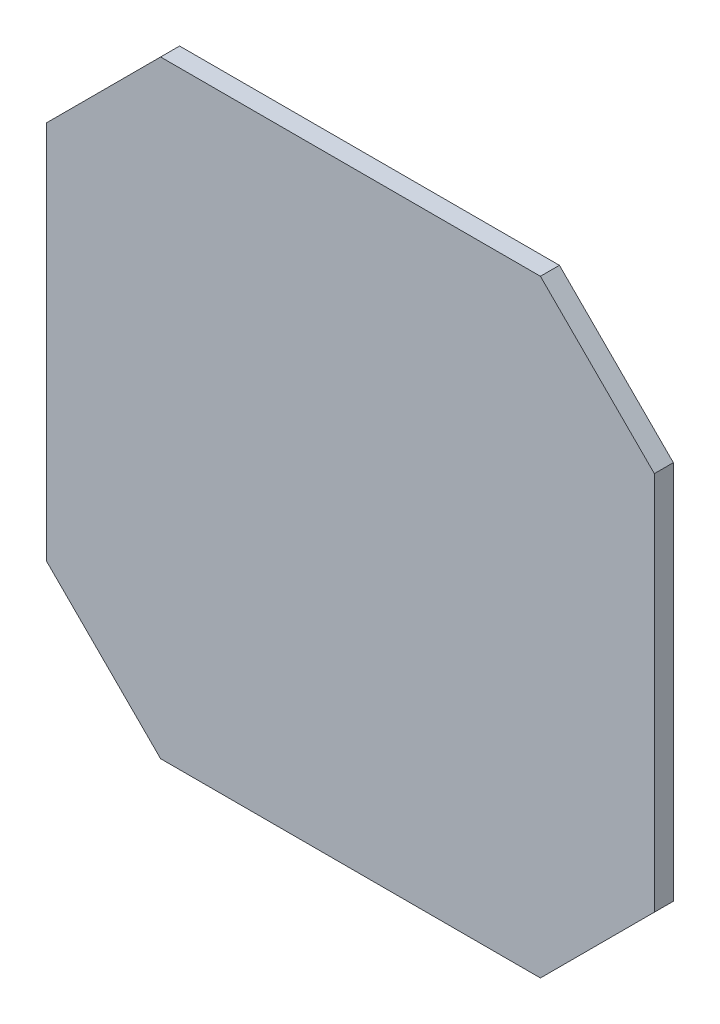
ISO-10303-21;
HEADER;
FILE_DESCRIPTION(('STEP AP214'),'2;1');
FILE_NAME('part.step','',(''),(''),'','','');
FILE_SCHEMA(('AUTOMOTIVE_DESIGN { 1 0 10303 214 1 1 1 1 }'));
ENDSEC;
DATA;
#1=APPLICATION_CONTEXT('core data for automotive mechanical design processes');
#2=APPLICATION_PROTOCOL_DEFINITION('international standard','automotive_design',2000,#1);
#3=PRODUCT_CONTEXT('',#1,'mechanical');
#4=PRODUCT('Part','Part','',(#3));
#5=PRODUCT_RELATED_PRODUCT_CATEGORY('part','',(#4));
#6=PRODUCT_DEFINITION_FORMATION('','',#4);
#7=PRODUCT_DEFINITION_CONTEXT('part definition',#1,'design');
#8=PRODUCT_DEFINITION('design','',#6,#7);
#9=PRODUCT_DEFINITION_SHAPE('','',#8);
#10=(LENGTH_UNIT() NAMED_UNIT(*) SI_UNIT(.MILLI.,.METRE.));
#11=(NAMED_UNIT(*) PLANE_ANGLE_UNIT() SI_UNIT($,.RADIAN.));
#12=(NAMED_UNIT(*) SI_UNIT($,.STERADIAN.) SOLID_ANGLE_UNIT());
#13=UNCERTAINTY_MEASURE_WITH_UNIT(LENGTH_MEASURE(1.E-05),#10,'distance_accuracy_value','');
#14=(GEOMETRIC_REPRESENTATION_CONTEXT(3) GLOBAL_UNCERTAINTY_ASSIGNED_CONTEXT((#13)) GLOBAL_UNIT_ASSIGNED_CONTEXT((#10,
#11,#12)) REPRESENTATION_CONTEXT('',''));
#15=CARTESIAN_POINT('',(0.,0.,0.));
#16=DIRECTION('',(0.,0.,1.));
#17=DIRECTION('',(1.,0.,0.));
#18=AXIS2_PLACEMENT_3D('',#15,#16,#17);
#19=CARTESIAN_POINT('',(-80.,50.,5.));
#20=DIRECTION('',(1.,0.,0.));
#21=DIRECTION('',(0.,1.,0.));
#22=AXIS2_PLACEMENT_3D('',#19,#20,#21);
#23=PLANE('',#22);
#24=DIRECTION('',(0.,-1.,0.));
#25=VECTOR('',#24,1.);
#26=CARTESIAN_POINT('',(-80.,50.,0.));
#27=LINE('',#26,#25);
#28=CARTESIAN_POINT('',(-80.,50.,0.));
#29=VERTEX_POINT('',#28);
#30=CARTESIAN_POINT('',(-80.,-50.0000000000003,0.));
#31=VERTEX_POINT('',#30);
#32=EDGE_CURVE('E140',#29,#31,#27,.T.);
#33=ORIENTED_EDGE('',*,*,#32,.T.);
#34=DIRECTION('',(0.,0.,-1.));
#35=VECTOR('',#34,1.);
#36=CARTESIAN_POINT('',(-80.,-50.0000000000003,5.));
#37=LINE('',#36,#35);
#38=CARTESIAN_POINT('',(-80.,-50.0000000000003,5.));
#39=VERTEX_POINT('',#38);
#40=EDGE_CURVE('E11',#39,#31,#37,.T.);
#41=ORIENTED_EDGE('',*,*,#40,.F.);
#42=DIRECTION('',(0.,-1.,0.));
#43=VECTOR('',#42,1.);
#44=CARTESIAN_POINT('',(-80.,50.,5.));
#45=LINE('',#44,#43);
#46=CARTESIAN_POINT('',(-80.,50.,5.));
#47=VERTEX_POINT('',#46);
#48=EDGE_CURVE('E162',#47,#39,#45,.T.);
#49=ORIENTED_EDGE('',*,*,#48,.F.);
#50=DIRECTION('',(0.,0.,-1.));
#51=VECTOR('',#50,1.);
#52=CARTESIAN_POINT('',(-80.,50.,5.));
#53=LINE('',#52,#51);
#54=EDGE_CURVE('E136',#47,#29,#53,.T.);
#55=ORIENTED_EDGE('',*,*,#54,.T.);
#56=EDGE_LOOP('',(#33,#41,#49,#55));
#57=FACE_BOUND('',#56,.T.);
#58=ADVANCED_FACE('F39',(#57),#23,.F.);
#59=CARTESIAN_POINT('',(-80.,-50.0000000000003,5.));
#60=DIRECTION('',(0.707106781186544,0.707106781186551,0.));
#61=DIRECTION('',(-0.707106781186551,0.707106781186544,0.));
#62=AXIS2_PLACEMENT_3D('',#59,#60,#61);
#63=PLANE('',#62);
#64=DIRECTION('',(0.707106781186551,-0.707106781186544,0.));
#65=VECTOR('',#64,1.);
#66=CARTESIAN_POINT('',(-80.,-50.0000000000003,0.));
#67=LINE('',#66,#65);
#68=CARTESIAN_POINT('',(-50.,-80.,0.));
#69=VERTEX_POINT('',#68);
#70=EDGE_CURVE('E144',#31,#69,#67,.T.);
#71=ORIENTED_EDGE('',*,*,#70,.T.);
#72=DIRECTION('',(0.,0.,-1.));
#73=VECTOR('',#72,1.);
#74=CARTESIAN_POINT('',(-50.,-80.,5.));
#75=LINE('',#74,#73);
#76=CARTESIAN_POINT('',(-50.,-80.,5.));
#77=VERTEX_POINT('',#76);
#78=EDGE_CURVE('E48',#77,#69,#75,.T.);
#79=ORIENTED_EDGE('',*,*,#78,.F.);
#80=DIRECTION('',(0.707106781186551,-0.707106781186544,0.));
#81=VECTOR('',#80,1.);
#82=CARTESIAN_POINT('',(-80.,-50.0000000000003,5.));
#83=LINE('',#82,#81);
#84=EDGE_CURVE('E99',#39,#77,#83,.T.);
#85=ORIENTED_EDGE('',*,*,#84,.F.);
#86=ORIENTED_EDGE('',*,*,#40,.T.);
#87=EDGE_LOOP('',(#71,#79,#85,#86));
#88=FACE_BOUND('',#87,.T.);
#89=ADVANCED_FACE('F208',(#88),#63,.F.);
#90=CARTESIAN_POINT('',(-50.,-80.,5.));
#91=DIRECTION('',(0.,1.,0.));
#92=DIRECTION('',(0.,0.,1.));
#93=AXIS2_PLACEMENT_3D('',#90,#91,#92);
#94=PLANE('',#93);
#95=DIRECTION('',(1.,0.,0.));
#96=VECTOR('',#95,1.);
#97=CARTESIAN_POINT('',(-50.,-80.,0.));
#98=LINE('',#97,#96);
#99=CARTESIAN_POINT('',(50.0000000000003,-80.,0.));
#100=VERTEX_POINT('',#99);
#101=EDGE_CURVE('E147',#69,#100,#98,.T.);
#102=ORIENTED_EDGE('',*,*,#101,.T.);
#103=DIRECTION('',(0.,0.,-1.));
#104=VECTOR('',#103,1.);
#105=CARTESIAN_POINT('',(50.0000000000003,-80.,5.));
#106=LINE('',#105,#104);
#107=CARTESIAN_POINT('',(50.0000000000003,-80.,5.));
#108=VERTEX_POINT('',#107);
#109=EDGE_CURVE('E173',#108,#100,#106,.T.);
#110=ORIENTED_EDGE('',*,*,#109,.F.);
#111=DIRECTION('',(1.,0.,0.));
#112=VECTOR('',#111,1.);
#113=CARTESIAN_POINT('',(-50.,-80.,5.));
#114=LINE('',#113,#112);
#115=EDGE_CURVE('E183',#77,#108,#114,.T.);
#116=ORIENTED_EDGE('',*,*,#115,.F.);
#117=ORIENTED_EDGE('',*,*,#78,.T.);
#118=EDGE_LOOP('',(#102,#110,#116,#117));
#119=FACE_BOUND('',#118,.T.);
#120=ADVANCED_FACE('F181',(#119),#94,.F.);
#121=CARTESIAN_POINT('',(50.0000000000003,-80.,5.));
#122=DIRECTION('',(-0.707106781186552,0.707106781186544,0.));
#123=DIRECTION('',(-0.707106781186544,-0.707106781186551,0.));
#124=AXIS2_PLACEMENT_3D('',#121,#122,#123);
#125=PLANE('',#124);
#126=DIRECTION('',(0.707106781186544,0.707106781186552,0.));
#127=VECTOR('',#126,1.);
#128=CARTESIAN_POINT('',(50.0000000000003,-80.,0.));
#129=LINE('',#128,#127);
#130=CARTESIAN_POINT('',(80.,-50.,0.));
#131=VERTEX_POINT('',#130);
#132=EDGE_CURVE('E150',#100,#131,#129,.T.);
#133=ORIENTED_EDGE('',*,*,#132,.T.);
#134=DIRECTION('',(0.,0.,-1.));
#135=VECTOR('',#134,1.);
#136=CARTESIAN_POINT('',(80.,-50.,5.));
#137=LINE('',#136,#135);
#138=CARTESIAN_POINT('',(80.,-50.,5.));
#139=VERTEX_POINT('',#138);
#140=EDGE_CURVE('E169',#139,#131,#137,.T.);
#141=ORIENTED_EDGE('',*,*,#140,.F.);
#142=DIRECTION('',(0.707106781186544,0.707106781186552,0.));
#143=VECTOR('',#142,1.);
#144=CARTESIAN_POINT('',(50.0000000000003,-80.,5.));
#145=LINE('',#144,#143);
#146=EDGE_CURVE('E196',#108,#139,#145,.T.);
#147=ORIENTED_EDGE('',*,*,#146,.F.);
#148=ORIENTED_EDGE('',*,*,#109,.T.);
#149=EDGE_LOOP('',(#133,#141,#147,#148));
#150=FACE_BOUND('',#149,.T.);
#151=ADVANCED_FACE('F191',(#150),#125,.F.);
#152=CARTESIAN_POINT('',(80.,-50.,5.));
#153=DIRECTION('',(-1.,0.,0.));
#154=DIRECTION('',(0.,-1.,0.));
#155=AXIS2_PLACEMENT_3D('',#152,#153,#154);
#156=PLANE('',#155);
#157=DIRECTION('',(0.,1.,0.));
#158=VECTOR('',#157,1.);
#159=CARTESIAN_POINT('',(80.,-50.,0.));
#160=LINE('',#159,#158);
#161=CARTESIAN_POINT('',(80.,50.0000000000003,0.));
#162=VERTEX_POINT('',#161);
#163=EDGE_CURVE('E153',#131,#162,#160,.T.);
#164=ORIENTED_EDGE('',*,*,#163,.T.);
#165=DIRECTION('',(0.,0.,-1.));
#166=VECTOR('',#165,1.);
#167=CARTESIAN_POINT('',(80.,50.0000000000003,5.));
#168=LINE('',#167,#166);
#169=CARTESIAN_POINT('',(80.,50.0000000000003,5.));
#170=VERTEX_POINT('',#169);
#171=EDGE_CURVE('E129',#170,#162,#168,.T.);
#172=ORIENTED_EDGE('',*,*,#171,.F.);
#173=DIRECTION('',(0.,1.,0.));
#174=VECTOR('',#173,1.);
#175=CARTESIAN_POINT('',(80.,-50.,5.));
#176=LINE('',#175,#174);
#177=EDGE_CURVE('E118',#139,#170,#176,.T.);
#178=ORIENTED_EDGE('',*,*,#177,.F.);
#179=ORIENTED_EDGE('',*,*,#140,.T.);
#180=EDGE_LOOP('',(#164,#172,#178,#179));
#181=FACE_BOUND('',#180,.T.);
#182=ADVANCED_FACE('F194',(#181),#156,.F.);
#183=CARTESIAN_POINT('',(80.,50.0000000000003,5.));
#184=DIRECTION('',(-0.707106781186544,-0.707106781186551,0.));
#185=DIRECTION('',(0.707106781186551,-0.707106781186544,0.));
#186=AXIS2_PLACEMENT_3D('',#183,#184,#185);
#187=PLANE('',#186);
#188=DIRECTION('',(-0.707106781186551,0.707106781186544,0.));
#189=VECTOR('',#188,1.);
#190=CARTESIAN_POINT('',(80.,50.0000000000003,0.));
#191=LINE('',#190,#189);
#192=CARTESIAN_POINT('',(50.,80.,0.));
#193=VERTEX_POINT('',#192);
#194=EDGE_CURVE('E127',#162,#193,#191,.T.);
#195=ORIENTED_EDGE('',*,*,#194,.T.);
#196=DIRECTION('',(0.,0.,-1.));
#197=VECTOR('',#196,1.);
#198=CARTESIAN_POINT('',(50.,80.,5.));
#199=LINE('',#198,#197);
#200=CARTESIAN_POINT('',(50.,80.,5.));
#201=VERTEX_POINT('',#200);
#202=EDGE_CURVE('E124',#201,#193,#199,.T.);
#203=ORIENTED_EDGE('',*,*,#202,.F.);
#204=DIRECTION('',(-0.707106781186551,0.707106781186544,0.));
#205=VECTOR('',#204,1.);
#206=CARTESIAN_POINT('',(80.,50.0000000000003,5.));
#207=LINE('',#206,#205);
#208=EDGE_CURVE('E112',#170,#201,#207,.T.);
#209=ORIENTED_EDGE('',*,*,#208,.F.);
#210=ORIENTED_EDGE('',*,*,#171,.T.);
#211=EDGE_LOOP('',(#195,#203,#209,#210));
#212=FACE_BOUND('',#211,.T.);
#213=ADVANCED_FACE('F125',(#212),#187,.F.);
#214=CARTESIAN_POINT('',(50.,80.,5.));
#215=DIRECTION('',(0.,-1.,0.));
#216=DIRECTION('',(1.,0.,0.));
#217=AXIS2_PLACEMENT_3D('',#214,#215,#216);
#218=PLANE('',#217);
#219=DIRECTION('',(-1.,0.,0.));
#220=VECTOR('',#219,1.);
#221=CARTESIAN_POINT('',(50.,80.,0.));
#222=LINE('',#221,#220);
#223=CARTESIAN_POINT('',(-50.0000000000004,80.,0.));
#224=VERTEX_POINT('',#223);
#225=EDGE_CURVE('E85',#193,#224,#222,.T.);
#226=ORIENTED_EDGE('',*,*,#225,.T.);
#227=DIRECTION('',(0.,0.,-1.));
#228=VECTOR('',#227,1.);
#229=CARTESIAN_POINT('',(-50.0000000000004,80.,5.));
#230=LINE('',#229,#228);
#231=CARTESIAN_POINT('',(-50.0000000000004,80.,5.));
#232=VERTEX_POINT('',#231);
#233=EDGE_CURVE('E130',#232,#224,#230,.T.);
#234=ORIENTED_EDGE('',*,*,#233,.F.);
#235=DIRECTION('',(-1.,0.,0.));
#236=VECTOR('',#235,1.);
#237=CARTESIAN_POINT('',(50.,80.,5.));
#238=LINE('',#237,#236);
#239=EDGE_CURVE('E116',#201,#232,#238,.T.);
#240=ORIENTED_EDGE('',*,*,#239,.F.);
#241=ORIENTED_EDGE('',*,*,#202,.T.);
#242=EDGE_LOOP('',(#226,#234,#240,#241));
#243=FACE_BOUND('',#242,.T.);
#244=ADVANCED_FACE('F132',(#243),#218,.F.);
#245=CARTESIAN_POINT('',(-50.0000000000004,80.,5.));
#246=DIRECTION('',(0.707106781186551,-0.707106781186544,0.));
#247=DIRECTION('',(0.707106781186544,0.707106781186551,0.));
#248=AXIS2_PLACEMENT_3D('',#245,#246,#247);
#249=PLANE('',#248);
#250=DIRECTION('',(-0.707106781186544,-0.707106781186551,0.));
#251=VECTOR('',#250,1.);
#252=CARTESIAN_POINT('',(-50.0000000000004,80.,0.));
#253=LINE('',#252,#251);
#254=EDGE_CURVE('E91',#224,#29,#253,.T.);
#255=ORIENTED_EDGE('',*,*,#254,.T.);
#256=ORIENTED_EDGE('',*,*,#54,.F.);
#257=DIRECTION('',(-0.707106781186544,-0.707106781186551,0.));
#258=VECTOR('',#257,1.);
#259=CARTESIAN_POINT('',(-50.0000000000004,80.,5.));
#260=LINE('',#259,#258);
#261=EDGE_CURVE('E56',#232,#47,#260,.T.);
#262=ORIENTED_EDGE('',*,*,#261,.F.);
#263=ORIENTED_EDGE('',*,*,#233,.T.);
#264=EDGE_LOOP('',(#255,#256,#262,#263));
#265=FACE_BOUND('',#264,.T.);
#266=ADVANCED_FACE('F224',(#265),#249,.F.);
#267=CARTESIAN_POINT('',(0.,0.,5.));
#268=DIRECTION('',(0.,0.,1.));
#269=DIRECTION('',(1.,0.,0.));
#270=AXIS2_PLACEMENT_3D('',#267,#268,#269);
#271=PLANE('',#270);
#272=ORIENTED_EDGE('',*,*,#48,.T.);
#273=ORIENTED_EDGE('',*,*,#84,.T.);
#274=ORIENTED_EDGE('',*,*,#115,.T.);
#275=ORIENTED_EDGE('',*,*,#146,.T.);
#276=ORIENTED_EDGE('',*,*,#177,.T.);
#277=ORIENTED_EDGE('',*,*,#208,.T.);
#278=ORIENTED_EDGE('',*,*,#239,.T.);
#279=ORIENTED_EDGE('',*,*,#261,.T.);
#280=EDGE_LOOP('',(#272,#273,#274,#275,#276,#277,#278,#279));
#281=FACE_BOUND('',#280,.T.);
#282=ADVANCED_FACE('F114',(#281),#271,.T.);
#283=CARTESIAN_POINT('',(0.,0.,0.));
#284=DIRECTION('',(0.,0.,1.));
#285=DIRECTION('',(1.,0.,0.));
#286=AXIS2_PLACEMENT_3D('',#283,#284,#285);
#287=PLANE('',#286);
#288=ORIENTED_EDGE('',*,*,#32,.F.);
#289=ORIENTED_EDGE('',*,*,#254,.F.);
#290=ORIENTED_EDGE('',*,*,#225,.F.);
#291=ORIENTED_EDGE('',*,*,#194,.F.);
#292=ORIENTED_EDGE('',*,*,#163,.F.);
#293=ORIENTED_EDGE('',*,*,#132,.F.);
#294=ORIENTED_EDGE('',*,*,#101,.F.);
#295=ORIENTED_EDGE('',*,*,#70,.F.);
#296=EDGE_LOOP('',(#288,#289,#290,#291,#292,#293,#294,#295));
#297=FACE_BOUND('',#296,.T.);
#298=ADVANCED_FACE('F187',(#297),#287,.F.);
#299=CLOSED_SHELL('',(#58,#89,#120,#151,#182,#213,#244,#266,#282,#298));
#300=MANIFOLD_SOLID_BREP('B2',#299);
#301=ADVANCED_BREP_SHAPE_REPRESENTATION('',(#18,#300),#14);
#302=SHAPE_DEFINITION_REPRESENTATION(#9,#301);
ENDSEC;
END-ISO-10303-21;
